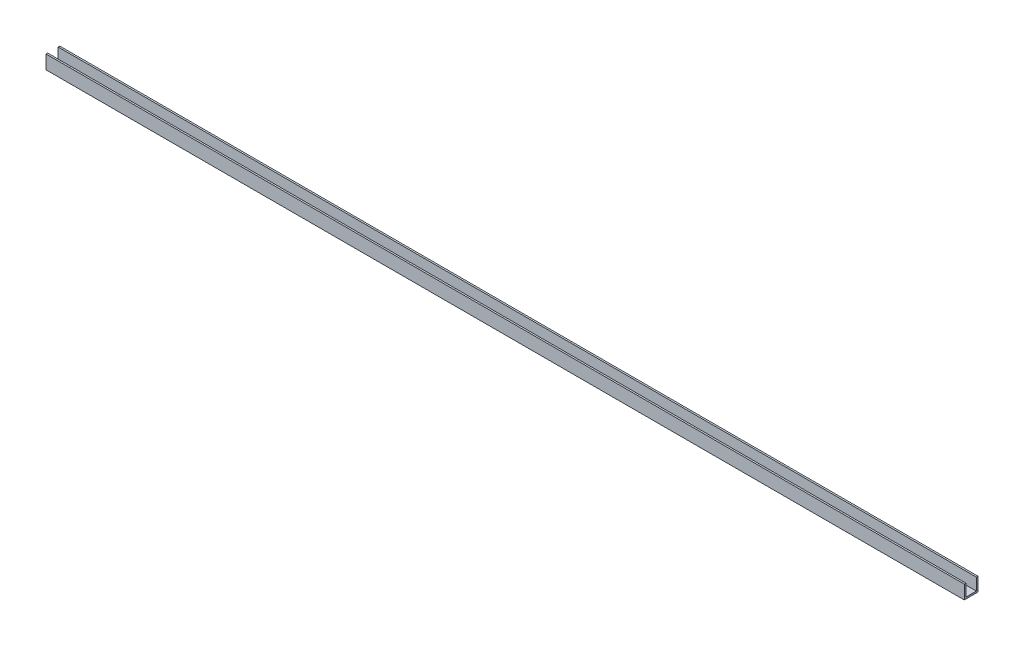
ISO-10303-21;
HEADER;
FILE_DESCRIPTION(('STEP AP214'),'2;1');
FILE_NAME('part.step','',(''),(''),'','','');
FILE_SCHEMA(('AUTOMOTIVE_DESIGN { 1 0 10303 214 1 1 1 1 }'));
ENDSEC;
DATA;
#1=APPLICATION_CONTEXT('core data for automotive mechanical design processes');
#2=APPLICATION_PROTOCOL_DEFINITION('international standard','automotive_design',2000,#1);
#3=PRODUCT_CONTEXT('',#1,'mechanical');
#4=PRODUCT('Part','Part','',(#3));
#5=PRODUCT_RELATED_PRODUCT_CATEGORY('part','',(#4));
#6=PRODUCT_DEFINITION_FORMATION('','',#4);
#7=PRODUCT_DEFINITION_CONTEXT('part definition',#1,'design');
#8=PRODUCT_DEFINITION('design','',#6,#7);
#9=PRODUCT_DEFINITION_SHAPE('','',#8);
#10=(LENGTH_UNIT() NAMED_UNIT(*) SI_UNIT(.MILLI.,.METRE.));
#11=(NAMED_UNIT(*) PLANE_ANGLE_UNIT() SI_UNIT($,.RADIAN.));
#12=(NAMED_UNIT(*) SI_UNIT($,.STERADIAN.) SOLID_ANGLE_UNIT());
#13=UNCERTAINTY_MEASURE_WITH_UNIT(LENGTH_MEASURE(1.E-05),#10,'distance_accuracy_value','');
#14=(GEOMETRIC_REPRESENTATION_CONTEXT(3) GLOBAL_UNCERTAINTY_ASSIGNED_CONTEXT((#13)) GLOBAL_UNIT_ASSIGNED_CONTEXT((#10,
#11,#12)) REPRESENTATION_CONTEXT('',''));
#15=CARTESIAN_POINT('',(0.,0.,0.));
#16=DIRECTION('',(0.,0.,1.));
#17=DIRECTION('',(1.,0.,0.));
#18=AXIS2_PLACEMENT_3D('',#15,#16,#17);
#19=CARTESIAN_POINT('',(835.,0.,-4.75));
#20=DIRECTION('',(0.,0.,1.));
#21=DIRECTION('',(1.,0.,0.));
#22=AXIS2_PLACEMENT_3D('',#19,#20,#21);
#23=PLANE('',#22);
#24=DIRECTION('',(0.,1.,0.));
#25=VECTOR('',#24,1.);
#26=CARTESIAN_POINT('',(0.,0.,-4.75));
#27=LINE('',#26,#25);
#28=CARTESIAN_POINT('',(0.,-4.75,-4.75));
#29=VERTEX_POINT('',#28);
#30=CARTESIAN_POINT('',(0.,6.25,-4.75));
#31=VERTEX_POINT('',#30);
#32=EDGE_CURVE('E129',#29,#31,#27,.T.);
#33=ORIENTED_EDGE('',*,*,#32,.F.);
#34=DIRECTION('',(-1.,0.,0.));
#35=VECTOR('',#34,1.);
#36=CARTESIAN_POINT('',(835.,-4.75,-4.75));
#37=LINE('',#36,#35);
#38=CARTESIAN_POINT('',(835.,-4.75,-4.75));
#39=VERTEX_POINT('',#38);
#40=EDGE_CURVE('E11',#39,#29,#37,.T.);
#41=ORIENTED_EDGE('',*,*,#40,.F.);
#42=DIRECTION('',(0.,1.,0.));
#43=VECTOR('',#42,1.);
#44=CARTESIAN_POINT('',(835.,0.,-4.75));
#45=LINE('',#44,#43);
#46=CARTESIAN_POINT('',(835.,6.25,-4.75));
#47=VERTEX_POINT('',#46);
#48=EDGE_CURVE('E173',#39,#47,#45,.T.);
#49=ORIENTED_EDGE('',*,*,#48,.T.);
#50=DIRECTION('',(-1.,0.,0.));
#51=VECTOR('',#50,1.);
#52=CARTESIAN_POINT('',(835.,6.25,-4.75));
#53=LINE('',#52,#51);
#54=EDGE_CURVE('E51',#47,#31,#53,.T.);
#55=ORIENTED_EDGE('',*,*,#54,.T.);
#56=EDGE_LOOP('',(#33,#41,#49,#55));
#57=FACE_BOUND('',#56,.T.);
#58=ADVANCED_FACE('F35',(#57),#23,.T.);
#59=CARTESIAN_POINT('',(835.,-4.75,0.));
#60=DIRECTION('',(0.,1.,0.));
#61=DIRECTION('',(0.,0.,1.));
#62=AXIS2_PLACEMENT_3D('',#59,#60,#61);
#63=PLANE('',#62);
#64=DIRECTION('',(0.,0.,-1.));
#65=VECTOR('',#64,1.);
#66=CARTESIAN_POINT('',(0.,-4.75,0.));
#67=LINE('',#66,#65);
#68=CARTESIAN_POINT('',(0.,-4.75,4.75));
#69=VERTEX_POINT('',#68);
#70=EDGE_CURVE('E131',#69,#29,#67,.T.);
#71=ORIENTED_EDGE('',*,*,#70,.F.);
#72=DIRECTION('',(-1.,0.,0.));
#73=VECTOR('',#72,1.);
#74=CARTESIAN_POINT('',(835.,-4.75,4.75));
#75=LINE('',#74,#73);
#76=CARTESIAN_POINT('',(835.,-4.75,4.75));
#77=VERTEX_POINT('',#76);
#78=EDGE_CURVE('E43',#77,#69,#75,.T.);
#79=ORIENTED_EDGE('',*,*,#78,.F.);
#80=DIRECTION('',(0.,0.,-1.));
#81=VECTOR('',#80,1.);
#82=CARTESIAN_POINT('',(835.,-4.75,0.));
#83=LINE('',#82,#81);
#84=EDGE_CURVE('E171',#77,#39,#83,.T.);
#85=ORIENTED_EDGE('',*,*,#84,.T.);
#86=ORIENTED_EDGE('',*,*,#40,.T.);
#87=EDGE_LOOP('',(#71,#79,#85,#86));
#88=FACE_BOUND('',#87,.T.);
#89=ADVANCED_FACE('F163',(#88),#63,.T.);
#90=CARTESIAN_POINT('',(835.,0.,4.75));
#91=DIRECTION('',(0.,0.,-1.));
#92=DIRECTION('',(0.,1.,0.));
#93=AXIS2_PLACEMENT_3D('',#90,#91,#92);
#94=PLANE('',#93);
#95=DIRECTION('',(0.,-1.,0.));
#96=VECTOR('',#95,1.);
#97=CARTESIAN_POINT('',(0.,0.,4.75));
#98=LINE('',#97,#96);
#99=CARTESIAN_POINT('',(0.,6.25,4.75));
#100=VERTEX_POINT('',#99);
#101=EDGE_CURVE('E134',#100,#69,#98,.T.);
#102=ORIENTED_EDGE('',*,*,#101,.F.);
#103=DIRECTION('',(-1.,0.,0.));
#104=VECTOR('',#103,1.);
#105=CARTESIAN_POINT('',(835.,6.25,4.75));
#106=LINE('',#105,#104);
#107=CARTESIAN_POINT('',(835.,6.25,4.75));
#108=VERTEX_POINT('',#107);
#109=EDGE_CURVE('E152',#108,#100,#106,.T.);
#110=ORIENTED_EDGE('',*,*,#109,.F.);
#111=DIRECTION('',(0.,-1.,0.));
#112=VECTOR('',#111,1.);
#113=CARTESIAN_POINT('',(835.,0.,4.75));
#114=LINE('',#113,#112);
#115=EDGE_CURVE('E159',#108,#77,#114,.T.);
#116=ORIENTED_EDGE('',*,*,#115,.T.);
#117=ORIENTED_EDGE('',*,*,#78,.T.);
#118=EDGE_LOOP('',(#102,#110,#116,#117));
#119=FACE_BOUND('',#118,.T.);
#120=ADVANCED_FACE('F157',(#119),#94,.T.);
#121=CARTESIAN_POINT('',(835.,6.25,0.));
#122=DIRECTION('',(0.,1.,0.));
#123=DIRECTION('',(0.,0.,1.));
#124=AXIS2_PLACEMENT_3D('',#121,#122,#123);
#125=PLANE('',#124);
#126=DIRECTION('',(0.,0.,-1.));
#127=VECTOR('',#126,1.);
#128=CARTESIAN_POINT('',(0.,6.25,0.));
#129=LINE('',#128,#127);
#130=CARTESIAN_POINT('',(0.,6.25,6.25));
#131=VERTEX_POINT('',#130);
#132=EDGE_CURVE('E137',#131,#100,#129,.T.);
#133=ORIENTED_EDGE('',*,*,#132,.F.);
#134=DIRECTION('',(-1.,0.,0.));
#135=VECTOR('',#134,1.);
#136=CARTESIAN_POINT('',(835.,6.25,6.25));
#137=LINE('',#136,#135);
#138=CARTESIAN_POINT('',(835.,6.25,6.25));
#139=VERTEX_POINT('',#138);
#140=EDGE_CURVE('E150',#139,#131,#137,.T.);
#141=ORIENTED_EDGE('',*,*,#140,.F.);
#142=DIRECTION('',(0.,0.,-1.));
#143=VECTOR('',#142,1.);
#144=CARTESIAN_POINT('',(835.,6.25,0.));
#145=LINE('',#144,#143);
#146=EDGE_CURVE('E126',#139,#108,#145,.T.);
#147=ORIENTED_EDGE('',*,*,#146,.T.);
#148=ORIENTED_EDGE('',*,*,#109,.T.);
#149=EDGE_LOOP('',(#133,#141,#147,#148));
#150=FACE_BOUND('',#149,.T.);
#151=ADVANCED_FACE('F169',(#150),#125,.T.);
#152=CARTESIAN_POINT('',(835.,0.,6.25));
#153=DIRECTION('',(0.,0.,1.));
#154=DIRECTION('',(1.,0.,0.));
#155=AXIS2_PLACEMENT_3D('',#152,#153,#154);
#156=PLANE('',#155);
#157=DIRECTION('',(0.,1.,0.));
#158=VECTOR('',#157,1.);
#159=CARTESIAN_POINT('',(0.,0.,6.25));
#160=LINE('',#159,#158);
#161=CARTESIAN_POINT('',(0.,-6.25,6.25));
#162=VERTEX_POINT('',#161);
#163=EDGE_CURVE('E140',#162,#131,#160,.T.);
#164=ORIENTED_EDGE('',*,*,#163,.F.);
#165=DIRECTION('',(-1.,0.,0.));
#166=VECTOR('',#165,1.);
#167=CARTESIAN_POINT('',(835.,-6.25,6.25));
#168=LINE('',#167,#166);
#169=CARTESIAN_POINT('',(835.,-6.25,6.25));
#170=VERTEX_POINT('',#169);
#171=EDGE_CURVE('E120',#170,#162,#168,.T.);
#172=ORIENTED_EDGE('',*,*,#171,.F.);
#173=DIRECTION('',(0.,1.,0.));
#174=VECTOR('',#173,1.);
#175=CARTESIAN_POINT('',(835.,0.,6.25));
#176=LINE('',#175,#174);
#177=EDGE_CURVE('E110',#170,#139,#176,.T.);
#178=ORIENTED_EDGE('',*,*,#177,.T.);
#179=ORIENTED_EDGE('',*,*,#140,.T.);
#180=EDGE_LOOP('',(#164,#172,#178,#179));
#181=FACE_BOUND('',#180,.T.);
#182=ADVANCED_FACE('F177',(#181),#156,.T.);
#183=CARTESIAN_POINT('',(835.,-6.25,0.));
#184=DIRECTION('',(0.,1.,0.));
#185=DIRECTION('',(0.,0.,1.));
#186=AXIS2_PLACEMENT_3D('',#183,#184,#185);
#187=PLANE('',#186);
#188=DIRECTION('',(0.,0.,-1.));
#189=VECTOR('',#188,1.);
#190=CARTESIAN_POINT('',(0.,-6.25,0.));
#191=LINE('',#190,#189);
#192=CARTESIAN_POINT('',(0.,-6.25,-6.25));
#193=VERTEX_POINT('',#192);
#194=EDGE_CURVE('E117',#162,#193,#191,.T.);
#195=ORIENTED_EDGE('',*,*,#194,.T.);
#196=DIRECTION('',(-1.,0.,0.));
#197=VECTOR('',#196,1.);
#198=CARTESIAN_POINT('',(835.,-6.25,-6.25));
#199=LINE('',#198,#197);
#200=CARTESIAN_POINT('',(835.,-6.25,-6.25));
#201=VERTEX_POINT('',#200);
#202=EDGE_CURVE('E114',#201,#193,#199,.T.);
#203=ORIENTED_EDGE('',*,*,#202,.F.);
#204=DIRECTION('',(0.,0.,-1.));
#205=VECTOR('',#204,1.);
#206=CARTESIAN_POINT('',(835.,-6.25,0.));
#207=LINE('',#206,#205);
#208=EDGE_CURVE('E102',#170,#201,#207,.T.);
#209=ORIENTED_EDGE('',*,*,#208,.F.);
#210=ORIENTED_EDGE('',*,*,#171,.T.);
#211=EDGE_LOOP('',(#195,#203,#209,#210));
#212=FACE_BOUND('',#211,.T.);
#213=ADVANCED_FACE('F115',(#212),#187,.F.);
#214=CARTESIAN_POINT('',(835.,0.,-6.25));
#215=DIRECTION('',(0.,0.,1.));
#216=DIRECTION('',(1.,0.,0.));
#217=AXIS2_PLACEMENT_3D('',#214,#215,#216);
#218=PLANE('',#217);
#219=DIRECTION('',(0.,1.,0.));
#220=VECTOR('',#219,1.);
#221=CARTESIAN_POINT('',(0.,0.,-6.25));
#222=LINE('',#221,#220);
#223=CARTESIAN_POINT('',(0.,6.25,-6.25));
#224=VERTEX_POINT('',#223);
#225=EDGE_CURVE('E145',#193,#224,#222,.T.);
#226=ORIENTED_EDGE('',*,*,#225,.T.);
#227=DIRECTION('',(-1.,0.,0.));
#228=VECTOR('',#227,1.);
#229=CARTESIAN_POINT('',(835.,6.25,-6.25));
#230=LINE('',#229,#228);
#231=CARTESIAN_POINT('',(835.,6.25,-6.25));
#232=VERTEX_POINT('',#231);
#233=EDGE_CURVE('E77',#232,#224,#230,.T.);
#234=ORIENTED_EDGE('',*,*,#233,.F.);
#235=DIRECTION('',(0.,1.,0.));
#236=VECTOR('',#235,1.);
#237=CARTESIAN_POINT('',(835.,0.,-6.25));
#238=LINE('',#237,#236);
#239=EDGE_CURVE('E107',#201,#232,#238,.T.);
#240=ORIENTED_EDGE('',*,*,#239,.F.);
#241=ORIENTED_EDGE('',*,*,#202,.T.);
#242=EDGE_LOOP('',(#226,#234,#240,#241));
#243=FACE_BOUND('',#242,.T.);
#244=ADVANCED_FACE('F122',(#243),#218,.F.);
#245=EDGE_CURVE('E141',#31,#224,#129,.T.);
#246=ORIENTED_EDGE('',*,*,#245,.F.);
#247=ORIENTED_EDGE('',*,*,#54,.F.);
#248=EDGE_CURVE('E123',#47,#232,#145,.T.);
#249=ORIENTED_EDGE('',*,*,#248,.T.);
#250=ORIENTED_EDGE('',*,*,#233,.T.);
#251=EDGE_LOOP('',(#246,#247,#249,#250));
#252=FACE_BOUND('',#251,.T.);
#253=ADVANCED_FACE('F179',(#252),#125,.T.);
#254=CARTESIAN_POINT('',(835.,0.,0.));
#255=DIRECTION('',(1.,0.,0.));
#256=DIRECTION('',(0.,0.,-1.));
#257=AXIS2_PLACEMENT_3D('',#254,#255,#256);
#258=PLANE('',#257);
#259=ORIENTED_EDGE('',*,*,#48,.F.);
#260=ORIENTED_EDGE('',*,*,#84,.F.);
#261=ORIENTED_EDGE('',*,*,#115,.F.);
#262=ORIENTED_EDGE('',*,*,#146,.F.);
#263=ORIENTED_EDGE('',*,*,#177,.F.);
#264=ORIENTED_EDGE('',*,*,#208,.T.);
#265=ORIENTED_EDGE('',*,*,#239,.T.);
#266=ORIENTED_EDGE('',*,*,#248,.F.);
#267=EDGE_LOOP('',(#259,#260,#261,#262,#263,#264,#265,#266));
#268=FACE_BOUND('',#267,.T.);
#269=ADVANCED_FACE('F104',(#268),#258,.T.);
#270=CARTESIAN_POINT('',(0.,0.,0.));
#271=DIRECTION('',(1.,0.,0.));
#272=DIRECTION('',(0.,0.,-1.));
#273=AXIS2_PLACEMENT_3D('',#270,#271,#272);
#274=PLANE('',#273);
#275=ORIENTED_EDGE('',*,*,#32,.T.);
#276=ORIENTED_EDGE('',*,*,#245,.T.);
#277=ORIENTED_EDGE('',*,*,#225,.F.);
#278=ORIENTED_EDGE('',*,*,#194,.F.);
#279=ORIENTED_EDGE('',*,*,#163,.T.);
#280=ORIENTED_EDGE('',*,*,#132,.T.);
#281=ORIENTED_EDGE('',*,*,#101,.T.);
#282=ORIENTED_EDGE('',*,*,#70,.T.);
#283=EDGE_LOOP('',(#275,#276,#277,#278,#279,#280,#281,#282));
#284=FACE_BOUND('',#283,.T.);
#285=ADVANCED_FACE('F165',(#284),#274,.F.);
#286=CLOSED_SHELL('',(#58,#89,#120,#151,#182,#213,#244,#253,#269,#285));
#287=MANIFOLD_SOLID_BREP('B2',#286);
#288=ADVANCED_BREP_SHAPE_REPRESENTATION('',(#18,#287),#14);
#289=SHAPE_DEFINITION_REPRESENTATION(#9,#288);
ENDSEC;
END-ISO-10303-21;
